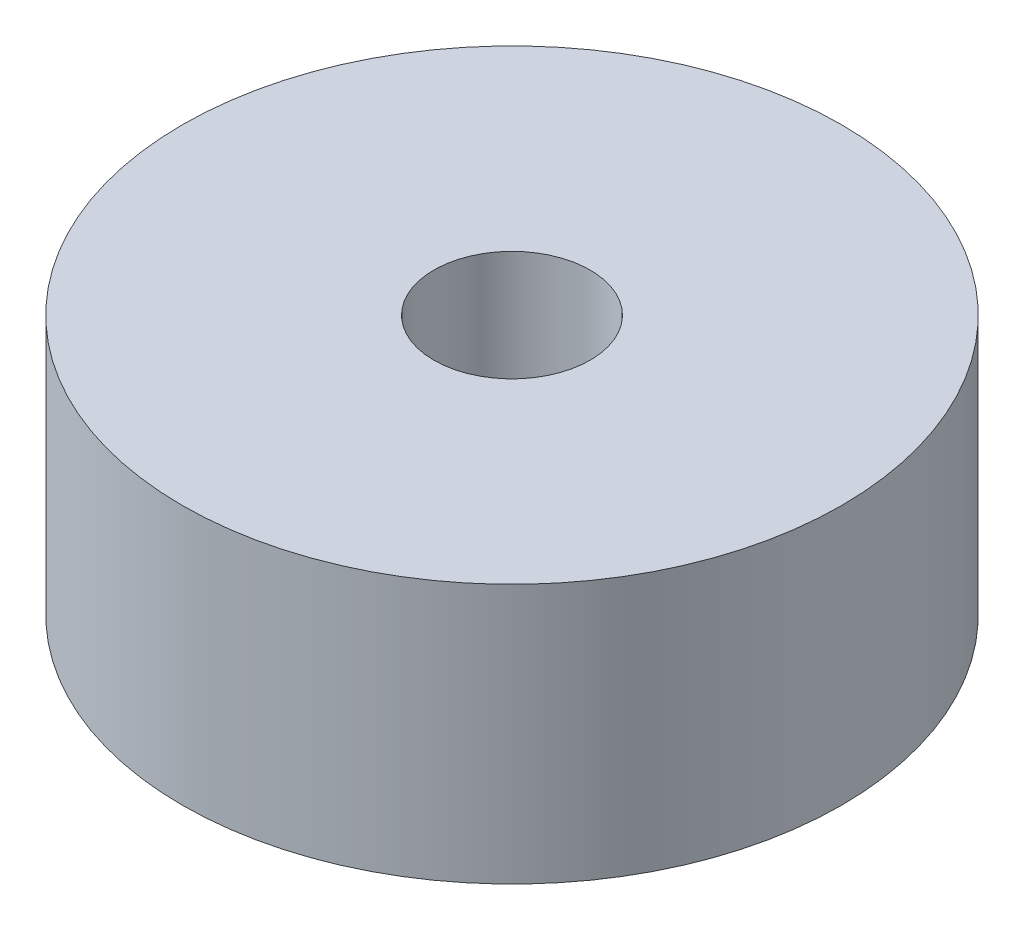
ISO-10303-21;
HEADER;
FILE_DESCRIPTION(('STEP AP214'),'2;1');
FILE_NAME('part.step','',(''),(''),'','','');
FILE_SCHEMA(('AUTOMOTIVE_DESIGN { 1 0 10303 214 1 1 1 1 }'));
ENDSEC;
DATA;
#1=APPLICATION_CONTEXT('core data for automotive mechanical design processes');
#2=APPLICATION_PROTOCOL_DEFINITION('international standard','automotive_design',2000,#1);
#3=PRODUCT_CONTEXT('',#1,'mechanical');
#4=PRODUCT('Part','Part','',(#3));
#5=PRODUCT_RELATED_PRODUCT_CATEGORY('part','',(#4));
#6=PRODUCT_DEFINITION_FORMATION('','',#4);
#7=PRODUCT_DEFINITION_CONTEXT('part definition',#1,'design');
#8=PRODUCT_DEFINITION('design','',#6,#7);
#9=PRODUCT_DEFINITION_SHAPE('','',#8);
#10=(LENGTH_UNIT() NAMED_UNIT(*) SI_UNIT(.MILLI.,.METRE.));
#11=(NAMED_UNIT(*) PLANE_ANGLE_UNIT() SI_UNIT($,.RADIAN.));
#12=(NAMED_UNIT(*) SI_UNIT($,.STERADIAN.) SOLID_ANGLE_UNIT());
#13=UNCERTAINTY_MEASURE_WITH_UNIT(LENGTH_MEASURE(1.E-05),#10,'distance_accuracy_value','');
#14=(GEOMETRIC_REPRESENTATION_CONTEXT(3) GLOBAL_UNCERTAINTY_ASSIGNED_CONTEXT((#13)) GLOBAL_UNIT_ASSIGNED_CONTEXT((#10,
#11,#12)) REPRESENTATION_CONTEXT('',''));
#15=CARTESIAN_POINT('',(0.,0.,0.));
#16=DIRECTION('',(0.,0.,1.));
#17=DIRECTION('',(1.,0.,0.));
#18=AXIS2_PLACEMENT_3D('',#15,#16,#17);
#19=CARTESIAN_POINT('',(0.,50.,0.));
#20=DIRECTION('',(0.,-1.,0.));
#21=DIRECTION('',(0.,0.,-1.));
#22=AXIS2_PLACEMENT_3D('',#19,#20,#21);
#23=CYLINDRICAL_SURFACE('',#22,63.5);
#24=CARTESIAN_POINT('',(0.,50.,0.));
#25=DIRECTION('',(0.,1.,0.));
#26=DIRECTION('',(0.,0.,1.));
#27=AXIS2_PLACEMENT_3D('',#24,#25,#26);
#28=CIRCLE('',#27,63.5);
#29=CARTESIAN_POINT('',(0.,50.,63.5));
#30=VERTEX_POINT('',#29);
#31=EDGE_CURVE('E10',#30,#30,#28,.T.);
#32=ORIENTED_EDGE('',*,*,#31,.F.);
#33=EDGE_LOOP('',(#32));
#34=FACE_BOUND('',#33,.T.);
#35=CARTESIAN_POINT('',(0.,0.,0.));
#36=DIRECTION('',(0.,1.,0.));
#37=DIRECTION('',(0.,0.,1.));
#38=AXIS2_PLACEMENT_3D('',#35,#36,#37);
#39=CIRCLE('',#38,63.5);
#40=CARTESIAN_POINT('',(0.,0.,63.5));
#41=VERTEX_POINT('',#40);
#42=EDGE_CURVE('E42',#41,#41,#39,.T.);
#43=ORIENTED_EDGE('',*,*,#42,.T.);
#44=EDGE_LOOP('',(#43));
#45=FACE_BOUND('',#44,.T.);
#46=ADVANCED_FACE('F39',(#34,#45),#23,.T.);
#47=CARTESIAN_POINT('',(0.,50.,0.));
#48=DIRECTION('',(0.,1.,0.));
#49=DIRECTION('',(0.,0.,1.));
#50=AXIS2_PLACEMENT_3D('',#47,#48,#49);
#51=PLANE('',#50);
#52=CARTESIAN_POINT('',(0.,50.,0.));
#53=DIRECTION('',(0.,1.,0.));
#54=DIRECTION('',(0.,0.,1.));
#55=AXIS2_PLACEMENT_3D('',#52,#53,#54);
#56=CIRCLE('',#55,15.05);
#57=CARTESIAN_POINT('',(0.,50.,15.05));
#58=VERTEX_POINT('',#57);
#59=EDGE_CURVE('E53',#58,#58,#56,.T.);
#60=ORIENTED_EDGE('',*,*,#59,.F.);
#61=EDGE_LOOP('',(#60));
#62=FACE_BOUND('',#61,.T.);
#63=ORIENTED_EDGE('',*,*,#31,.T.);
#64=EDGE_LOOP('',(#63));
#65=FACE_BOUND('',#64,.T.);
#66=ADVANCED_FACE('F59',(#62,#65),#51,.T.);
#67=CARTESIAN_POINT('',(0.,0.,0.));
#68=DIRECTION('',(0.,1.,0.));
#69=DIRECTION('',(0.,0.,1.));
#70=AXIS2_PLACEMENT_3D('',#67,#68,#69);
#71=PLANE('',#70);
#72=CARTESIAN_POINT('',(0.,0.,0.));
#73=DIRECTION('',(0.,1.,0.));
#74=DIRECTION('',(0.,0.,1.));
#75=AXIS2_PLACEMENT_3D('',#72,#73,#74);
#76=CIRCLE('',#75,15.05);
#77=CARTESIAN_POINT('',(0.,0.,15.05));
#78=VERTEX_POINT('',#77);
#79=EDGE_CURVE('E49',#78,#78,#76,.F.);
#80=ORIENTED_EDGE('',*,*,#79,.F.);
#81=EDGE_LOOP('',(#80));
#82=FACE_BOUND('',#81,.T.);
#83=ORIENTED_EDGE('',*,*,#42,.F.);
#84=EDGE_LOOP('',(#83));
#85=FACE_BOUND('',#84,.T.);
#86=ADVANCED_FACE('F61',(#82,#85),#71,.F.);
#87=CARTESIAN_POINT('',(0.,-42.5678282274302,0.));
#88=DIRECTION('',(0.,1.,0.));
#89=DIRECTION('',(0.,0.,1.));
#90=AXIS2_PLACEMENT_3D('',#87,#88,#89);
#91=CYLINDRICAL_SURFACE('',#90,15.05);
#92=ORIENTED_EDGE('',*,*,#79,.T.);
#93=EDGE_LOOP('',(#92));
#94=FACE_BOUND('',#93,.T.);
#95=ORIENTED_EDGE('',*,*,#59,.T.);
#96=EDGE_LOOP('',(#95));
#97=FACE_BOUND('',#96,.T.);
#98=ADVANCED_FACE('F57',(#94,#97),#91,.F.);
#99=CLOSED_SHELL('',(#46,#66,#86,#98));
#100=MANIFOLD_SOLID_BREP('B2',#99);
#101=ADVANCED_BREP_SHAPE_REPRESENTATION('',(#18,#100),#14);
#102=SHAPE_DEFINITION_REPRESENTATION(#9,#101);
ENDSEC;
END-ISO-10303-21;
